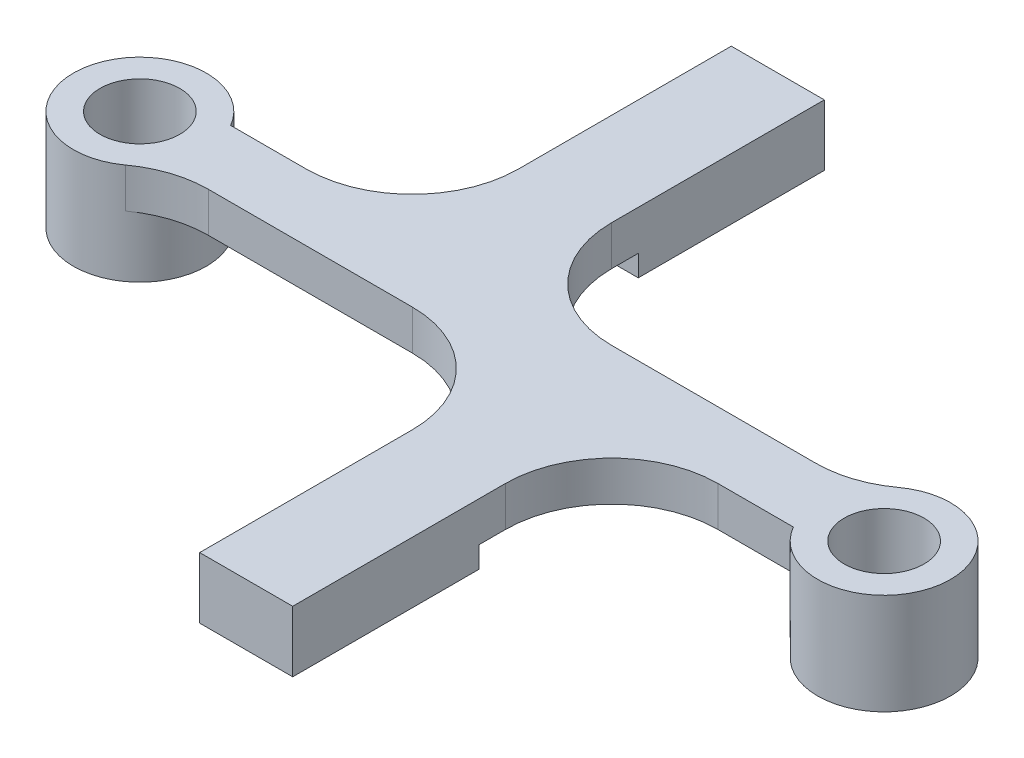
ISO-10303-21;
HEADER;
FILE_DESCRIPTION(('STEP AP214'),'2;1');
FILE_NAME('part.step','',(''),(''),'','','');
FILE_SCHEMA(('AUTOMOTIVE_DESIGN { 1 0 10303 214 1 1 1 1 }'));
ENDSEC;
DATA;
#1=APPLICATION_CONTEXT('core data for automotive mechanical design processes');
#2=APPLICATION_PROTOCOL_DEFINITION('international standard','automotive_design',2000,#1);
#3=PRODUCT_CONTEXT('',#1,'mechanical');
#4=PRODUCT('Part','Part','',(#3));
#5=PRODUCT_RELATED_PRODUCT_CATEGORY('part','',(#4));
#6=PRODUCT_DEFINITION_FORMATION('','',#4);
#7=PRODUCT_DEFINITION_CONTEXT('part definition',#1,'design');
#8=PRODUCT_DEFINITION('design','',#6,#7);
#9=PRODUCT_DEFINITION_SHAPE('','',#8);
#10=(LENGTH_UNIT() NAMED_UNIT(*) SI_UNIT(.MILLI.,.METRE.));
#11=(NAMED_UNIT(*) PLANE_ANGLE_UNIT() SI_UNIT($,.RADIAN.));
#12=(NAMED_UNIT(*) SI_UNIT($,.STERADIAN.) SOLID_ANGLE_UNIT());
#13=UNCERTAINTY_MEASURE_WITH_UNIT(LENGTH_MEASURE(1.E-05),#10,'distance_accuracy_value','');
#14=(GEOMETRIC_REPRESENTATION_CONTEXT(3) GLOBAL_UNCERTAINTY_ASSIGNED_CONTEXT((#13)) GLOBAL_UNIT_ASSIGNED_CONTEXT((#10,
#11,#12)) REPRESENTATION_CONTEXT('',''));
#15=CARTESIAN_POINT('',(0.,0.,0.));
#16=DIRECTION('',(0.,0.,1.));
#17=DIRECTION('',(1.,0.,0.));
#18=AXIS2_PLACEMENT_3D('',#15,#16,#17);
#19=CARTESIAN_POINT('',(-1.5,-12.5,0.));
#20=DIRECTION('',(1.,0.,0.));
#21=DIRECTION('',(0.,0.,-1.));
#22=AXIS2_PLACEMENT_3D('',#19,#20,#21);
#23=PLANE('',#22);
#24=DIRECTION('',(0.,0.,-1.));
#25=VECTOR('',#24,1.);
#26=CARTESIAN_POINT('',(-1.5,3.8,0.));
#27=LINE('',#26,#25);
#28=CARTESIAN_POINT('',(-1.5,3.8,-5.25));
#29=VERTEX_POINT('',#28);
#30=CARTESIAN_POINT('',(-1.5,3.8,-13.25));
#31=VERTEX_POINT('',#30);
#32=EDGE_CURVE('E239',#29,#31,#27,.T.);
#33=ORIENTED_EDGE('',*,*,#32,.F.);
#34=DIRECTION('',(0.,1.,0.));
#35=VECTOR('',#34,1.);
#36=CARTESIAN_POINT('',(-1.5,2.3,-5.25));
#37=LINE('',#36,#35);
#38=CARTESIAN_POINT('',(-1.5,2.3,-5.25));
#39=VERTEX_POINT('',#38);
#40=EDGE_CURVE('E296',#29,#39,#37,.F.);
#41=ORIENTED_EDGE('',*,*,#40,.T.);
#42=DIRECTION('',(0.,0.,1.));
#43=VECTOR('',#42,1.);
#44=CARTESIAN_POINT('',(-1.5,2.3,0.));
#45=LINE('',#44,#43);
#46=CARTESIAN_POINT('',(-1.5,2.3,-6.25));
#47=VERTEX_POINT('',#46);
#48=EDGE_CURVE('E376',#47,#39,#45,.T.);
#49=ORIENTED_EDGE('',*,*,#48,.F.);
#50=DIRECTION('',(0.,-1.,0.));
#51=VECTOR('',#50,1.);
#52=CARTESIAN_POINT('',(-1.5,30.567758347317,-6.25));
#53=LINE('',#52,#51);
#54=CARTESIAN_POINT('',(-1.5,1.5,-6.25));
#55=VERTEX_POINT('',#54);
#56=EDGE_CURVE('E229',#47,#55,#53,.T.);
#57=ORIENTED_EDGE('',*,*,#56,.T.);
#58=DIRECTION('',(0.,0.,1.));
#59=VECTOR('',#58,1.);
#60=CARTESIAN_POINT('',(-1.5,1.5,-13.25));
#61=LINE('',#60,#59);
#62=CARTESIAN_POINT('',(-1.5,1.5,-13.25));
#63=VERTEX_POINT('',#62);
#64=EDGE_CURVE('E212',#63,#55,#61,.T.);
#65=ORIENTED_EDGE('',*,*,#64,.F.);
#66=DIRECTION('',(0.,1.,0.));
#67=VECTOR('',#66,1.);
#68=CARTESIAN_POINT('',(-1.5,-12.5,-13.25));
#69=LINE('',#68,#67);
#70=EDGE_CURVE('E226',#63,#31,#69,.T.);
#71=ORIENTED_EDGE('',*,*,#70,.T.);
#72=EDGE_LOOP('',(#33,#41,#49,#57,#65,#71));
#73=FACE_BOUND('',#72,.T.);
#74=ADVANCED_FACE('F62',(#73),#23,.T.);
#75=CARTESIAN_POINT('',(0.,-12.5,-13.25));
#76=DIRECTION('',(0.,0.,1.));
#77=DIRECTION('',(1.,0.,0.));
#78=AXIS2_PLACEMENT_3D('',#75,#76,#77);
#79=PLANE('',#78);
#80=DIRECTION('',(1.,0.,0.));
#81=VECTOR('',#80,1.);
#82=CARTESIAN_POINT('',(-5.,1.5,-13.25));
#83=LINE('',#82,#81);
#84=CARTESIAN_POINT('',(-5.,1.5,-13.25));
#85=VERTEX_POINT('',#84);
#86=EDGE_CURVE('E209',#85,#63,#83,.T.);
#87=ORIENTED_EDGE('',*,*,#86,.F.);
#88=DIRECTION('',(0.,1.,0.));
#89=VECTOR('',#88,1.);
#90=CARTESIAN_POINT('',(-5.,-12.5,-13.25));
#91=LINE('',#90,#89);
#92=CARTESIAN_POINT('',(-5.,3.8,-13.25));
#93=VERTEX_POINT('',#92);
#94=EDGE_CURVE('E235',#85,#93,#91,.T.);
#95=ORIENTED_EDGE('',*,*,#94,.T.);
#96=DIRECTION('',(1.,0.,0.));
#97=VECTOR('',#96,1.);
#98=CARTESIAN_POINT('',(0.,3.8,-13.25));
#99=LINE('',#98,#97);
#100=EDGE_CURVE('E234',#93,#31,#99,.T.);
#101=ORIENTED_EDGE('',*,*,#100,.T.);
#102=ORIENTED_EDGE('',*,*,#70,.F.);
#103=EDGE_LOOP('',(#87,#95,#101,#102));
#104=FACE_BOUND('',#103,.T.);
#105=ADVANCED_FACE('F232',(#104),#79,.F.);
#106=CARTESIAN_POINT('',(-5.,-12.5,0.));
#107=DIRECTION('',(1.,0.,0.));
#108=DIRECTION('',(0.,0.,-1.));
#109=AXIS2_PLACEMENT_3D('',#106,#107,#108);
#110=PLANE('',#109);
#111=DIRECTION('',(0.,0.,-1.));
#112=VECTOR('',#111,1.);
#113=CARTESIAN_POINT('',(-5.,2.3,0.));
#114=LINE('',#113,#112);
#115=CARTESIAN_POINT('',(-5.,2.3,-5.25));
#116=VERTEX_POINT('',#115);
#117=CARTESIAN_POINT('',(-5.,2.3,-6.25));
#118=VERTEX_POINT('',#117);
#119=EDGE_CURVE('E383',#116,#118,#114,.T.);
#120=ORIENTED_EDGE('',*,*,#119,.F.);
#121=DIRECTION('',(0.,1.,0.));
#122=VECTOR('',#121,1.);
#123=CARTESIAN_POINT('',(-5.,-12.5,-5.25));
#124=LINE('',#123,#122);
#125=CARTESIAN_POINT('',(-5.,3.8,-5.25));
#126=VERTEX_POINT('',#125);
#127=EDGE_CURVE('E278',#116,#126,#124,.T.);
#128=ORIENTED_EDGE('',*,*,#127,.T.);
#129=DIRECTION('',(0.,0.,-1.));
#130=VECTOR('',#129,1.);
#131=CARTESIAN_POINT('',(-5.,3.8,0.));
#132=LINE('',#131,#130);
#133=EDGE_CURVE('E401',#126,#93,#132,.T.);
#134=ORIENTED_EDGE('',*,*,#133,.T.);
#135=ORIENTED_EDGE('',*,*,#94,.F.);
#136=DIRECTION('',(0.,0.,-1.));
#137=VECTOR('',#136,1.);
#138=CARTESIAN_POINT('',(-5.,1.5,-6.25));
#139=LINE('',#138,#137);
#140=CARTESIAN_POINT('',(-5.,1.5,-6.25));
#141=VERTEX_POINT('',#140);
#142=EDGE_CURVE('E215',#141,#85,#139,.T.);
#143=ORIENTED_EDGE('',*,*,#142,.F.);
#144=DIRECTION('',(0.,-1.,0.));
#145=VECTOR('',#144,1.);
#146=CARTESIAN_POINT('',(-5.,30.567758347317,-6.25));
#147=LINE('',#146,#145);
#148=EDGE_CURVE('E382',#118,#141,#147,.T.);
#149=ORIENTED_EDGE('',*,*,#148,.F.);
#150=EDGE_LOOP('',(#120,#128,#134,#135,#143,#149));
#151=FACE_BOUND('',#150,.T.);
#152=ADVANCED_FACE('F466',(#151),#110,.F.);
#153=CARTESIAN_POINT('',(5.,-12.5,1.25));
#154=DIRECTION('',(-1.,0.,0.));
#155=DIRECTION('',(0.,0.,1.));
#156=AXIS2_PLACEMENT_3D('',#153,#154,#155);
#157=PLANE('',#156);
#158=DIRECTION('',(0.,0.,1.));
#159=VECTOR('',#158,1.);
#160=CARTESIAN_POINT('',(5.,2.3,0.));
#161=LINE('',#160,#159);
#162=CARTESIAN_POINT('',(5.,2.3,5.25));
#163=VERTEX_POINT('',#162);
#164=CARTESIAN_POINT('',(5.,2.3,6.25));
#165=VERTEX_POINT('',#164);
#166=EDGE_CURVE('E365',#163,#165,#161,.T.);
#167=ORIENTED_EDGE('',*,*,#166,.F.);
#168=DIRECTION('',(0.,1.,0.));
#169=VECTOR('',#168,1.);
#170=CARTESIAN_POINT('',(5.,3.8,5.25));
#171=LINE('',#170,#169);
#172=CARTESIAN_POINT('',(5.,3.8,5.25));
#173=VERTEX_POINT('',#172);
#174=EDGE_CURVE('E283',#163,#173,#171,.T.);
#175=ORIENTED_EDGE('',*,*,#174,.T.);
#176=DIRECTION('',(0.,0.,1.));
#177=VECTOR('',#176,1.);
#178=CARTESIAN_POINT('',(5.,3.8,6.25));
#179=LINE('',#178,#177);
#180=CARTESIAN_POINT('',(5.,3.8,13.25));
#181=VERTEX_POINT('',#180);
#182=EDGE_CURVE('E396',#173,#181,#179,.T.);
#183=ORIENTED_EDGE('',*,*,#182,.T.);
#184=DIRECTION('',(0.,1.,0.));
#185=VECTOR('',#184,1.);
#186=CARTESIAN_POINT('',(5.,-12.5,13.25));
#187=LINE('',#186,#185);
#188=CARTESIAN_POINT('',(5.,1.5,13.25));
#189=VERTEX_POINT('',#188);
#190=EDGE_CURVE('E354',#189,#181,#187,.T.);
#191=ORIENTED_EDGE('',*,*,#190,.F.);
#192=DIRECTION('',(0.,0.,1.));
#193=VECTOR('',#192,1.);
#194=CARTESIAN_POINT('',(5.,1.5,6.25));
#195=LINE('',#194,#193);
#196=CARTESIAN_POINT('',(5.,1.5,6.25));
#197=VERTEX_POINT('',#196);
#198=EDGE_CURVE('E440',#197,#189,#195,.T.);
#199=ORIENTED_EDGE('',*,*,#198,.F.);
#200=DIRECTION('',(0.,-1.,0.));
#201=VECTOR('',#200,1.);
#202=CARTESIAN_POINT('',(5.,30.567758347317,6.25));
#203=LINE('',#202,#201);
#204=EDGE_CURVE('E367',#165,#197,#203,.T.);
#205=ORIENTED_EDGE('',*,*,#204,.F.);
#206=EDGE_LOOP('',(#167,#175,#183,#191,#199,#205));
#207=FACE_BOUND('',#206,.T.);
#208=ADVANCED_FACE('F437',(#207),#157,.F.);
#209=CARTESIAN_POINT('',(1.5,-12.5,1.25));
#210=DIRECTION('',(-1.,0.,0.));
#211=DIRECTION('',(0.,0.,1.));
#212=AXIS2_PLACEMENT_3D('',#209,#210,#211);
#213=PLANE('',#212);
#214=DIRECTION('',(0.,0.,1.));
#215=VECTOR('',#214,1.);
#216=CARTESIAN_POINT('',(1.5,3.8,6.25));
#217=LINE('',#216,#215);
#218=CARTESIAN_POINT('',(1.5,3.8,5.25));
#219=VERTEX_POINT('',#218);
#220=CARTESIAN_POINT('',(1.5,3.8,13.25));
#221=VERTEX_POINT('',#220);
#222=EDGE_CURVE('E393',#219,#221,#217,.T.);
#223=ORIENTED_EDGE('',*,*,#222,.F.);
#224=DIRECTION('',(0.,1.,0.));
#225=VECTOR('',#224,1.);
#226=CARTESIAN_POINT('',(1.5,-12.5,5.25));
#227=LINE('',#226,#225);
#228=CARTESIAN_POINT('',(1.5,2.3,5.25));
#229=VERTEX_POINT('',#228);
#230=EDGE_CURVE('E77',#219,#229,#227,.F.);
#231=ORIENTED_EDGE('',*,*,#230,.T.);
#232=DIRECTION('',(0.,0.,-1.));
#233=VECTOR('',#232,1.);
#234=CARTESIAN_POINT('',(1.5,2.3,0.));
#235=LINE('',#234,#233);
#236=CARTESIAN_POINT('',(1.5,2.3,6.25));
#237=VERTEX_POINT('',#236);
#238=EDGE_CURVE('E351',#237,#229,#235,.T.);
#239=ORIENTED_EDGE('',*,*,#238,.F.);
#240=DIRECTION('',(0.,-1.,0.));
#241=VECTOR('',#240,1.);
#242=CARTESIAN_POINT('',(1.5,30.567758347317,6.25));
#243=LINE('',#242,#241);
#244=CARTESIAN_POINT('',(1.5,1.5,6.25));
#245=VERTEX_POINT('',#244);
#246=EDGE_CURVE('E356',#237,#245,#243,.T.);
#247=ORIENTED_EDGE('',*,*,#246,.T.);
#248=DIRECTION('',(0.,0.,-1.));
#249=VECTOR('',#248,1.);
#250=CARTESIAN_POINT('',(1.5,1.5,13.25));
#251=LINE('',#250,#249);
#252=CARTESIAN_POINT('',(1.5,1.5,13.25));
#253=VERTEX_POINT('',#252);
#254=EDGE_CURVE('E447',#253,#245,#251,.T.);
#255=ORIENTED_EDGE('',*,*,#254,.F.);
#256=DIRECTION('',(0.,1.,0.));
#257=VECTOR('',#256,1.);
#258=CARTESIAN_POINT('',(1.5,-12.5,13.25));
#259=LINE('',#258,#257);
#260=EDGE_CURVE('E350',#253,#221,#259,.T.);
#261=ORIENTED_EDGE('',*,*,#260,.T.);
#262=EDGE_LOOP('',(#223,#231,#239,#247,#255,#261));
#263=FACE_BOUND('',#262,.T.);
#264=ADVANCED_FACE('F445',(#263),#213,.T.);
#265=CARTESIAN_POINT('',(1.5,-12.5,13.25));
#266=DIRECTION('',(0.,0.,1.));
#267=DIRECTION('',(1.,0.,0.));
#268=AXIS2_PLACEMENT_3D('',#265,#266,#267);
#269=PLANE('',#268);
#270=ORIENTED_EDGE('',*,*,#260,.F.);
#271=DIRECTION('',(-1.,0.,0.));
#272=VECTOR('',#271,1.);
#273=CARTESIAN_POINT('',(5.,1.5,13.25));
#274=LINE('',#273,#272);
#275=EDGE_CURVE('E220',#189,#253,#274,.T.);
#276=ORIENTED_EDGE('',*,*,#275,.F.);
#277=ORIENTED_EDGE('',*,*,#190,.T.);
#278=DIRECTION('',(1.,0.,0.));
#279=VECTOR('',#278,1.);
#280=CARTESIAN_POINT('',(1.5,3.8,13.25));
#281=LINE('',#280,#279);
#282=EDGE_CURVE('E398',#221,#181,#281,.T.);
#283=ORIENTED_EDGE('',*,*,#282,.F.);
#284=EDGE_LOOP('',(#270,#276,#277,#283));
#285=FACE_BOUND('',#284,.T.);
#286=ADVANCED_FACE('F454',(#285),#269,.T.);
#287=CARTESIAN_POINT('',(0.,30.567758347317,-6.25));
#288=DIRECTION('',(0.,0.,-1.));
#289=DIRECTION('',(-1.,0.,0.));
#290=AXIS2_PLACEMENT_3D('',#287,#288,#289);
#291=PLANE('',#290);
#292=DIRECTION('',(-1.,0.,0.));
#293=VECTOR('',#292,1.);
#294=CARTESIAN_POINT('',(-1.5,1.5,-6.25));
#295=LINE('',#294,#293);
#296=EDGE_CURVE('E230',#55,#141,#295,.T.);
#297=ORIENTED_EDGE('',*,*,#296,.F.);
#298=ORIENTED_EDGE('',*,*,#56,.F.);
#299=DIRECTION('',(1.,0.,0.));
#300=VECTOR('',#299,1.);
#301=CARTESIAN_POINT('',(0.,2.3,-6.25));
#302=LINE('',#301,#300);
#303=EDGE_CURVE('E379',#118,#47,#302,.T.);
#304=ORIENTED_EDGE('',*,*,#303,.F.);
#305=ORIENTED_EDGE('',*,*,#148,.T.);
#306=EDGE_LOOP('',(#297,#298,#304,#305));
#307=FACE_BOUND('',#306,.T.);
#308=ADVANCED_FACE('F652',(#307),#291,.F.);
#309=CARTESIAN_POINT('',(0.,30.567758347317,6.25));
#310=DIRECTION('',(0.,0.,-1.));
#311=DIRECTION('',(-1.,0.,0.));
#312=AXIS2_PLACEMENT_3D('',#309,#310,#311);
#313=PLANE('',#312);
#314=ORIENTED_EDGE('',*,*,#204,.T.);
#315=DIRECTION('',(1.,0.,0.));
#316=VECTOR('',#315,1.);
#317=CARTESIAN_POINT('',(1.5,1.5,6.25));
#318=LINE('',#317,#316);
#319=EDGE_CURVE('E444',#245,#197,#318,.T.);
#320=ORIENTED_EDGE('',*,*,#319,.F.);
#321=ORIENTED_EDGE('',*,*,#246,.F.);
#322=DIRECTION('',(1.,0.,0.));
#323=VECTOR('',#322,1.);
#324=CARTESIAN_POINT('',(0.,2.3,6.25));
#325=LINE('',#324,#323);
#326=EDGE_CURVE('E361',#237,#165,#325,.T.);
#327=ORIENTED_EDGE('',*,*,#326,.T.);
#328=EDGE_LOOP('',(#314,#320,#321,#327));
#329=FACE_BOUND('',#328,.T.);
#330=ADVANCED_FACE('F443',(#329),#313,.T.);
#331=CARTESIAN_POINT('',(0.,0.,0.));
#332=DIRECTION('',(0.,1.,0.));
#333=DIRECTION('',(0.,0.,1.));
#334=AXIS2_PLACEMENT_3D('',#331,#332,#333);
#335=PLANE('',#334);
#336=CARTESIAN_POINT('',(14.,0.,0.));
#337=DIRECTION('',(0.,1.,0.));
#338=DIRECTION('',(0.,0.,1.));
#339=AXIS2_PLACEMENT_3D('',#336,#337,#338);
#340=CIRCLE('',#339,1.5);
#341=CARTESIAN_POINT('',(14.,0.,-1.5));
#342=VERTEX_POINT('',#341);
#343=EDGE_CURVE('E246',#342,#342,#340,.T.);
#344=ORIENTED_EDGE('',*,*,#343,.T.);
#345=EDGE_LOOP('',(#344));
#346=FACE_BOUND('',#345,.T.);
#347=CARTESIAN_POINT('',(14.,0.,0.));
#348=DIRECTION('',(0.,1.,0.));
#349=DIRECTION('',(0.,0.,1.));
#350=AXIS2_PLACEMENT_3D('',#347,#348,#349);
#351=CIRCLE('',#350,2.5);
#352=CARTESIAN_POINT('',(14.,0.,2.5));
#353=VERTEX_POINT('',#352);
#354=EDGE_CURVE('E268',#353,#353,#351,.T.);
#355=ORIENTED_EDGE('',*,*,#354,.F.);
#356=EDGE_LOOP('',(#355));
#357=FACE_BOUND('',#356,.T.);
#358=ADVANCED_FACE('F477',(#346,#357),#335,.F.);
#359=CARTESIAN_POINT('',(-14.,0.,0.));
#360=DIRECTION('',(0.,1.,0.));
#361=DIRECTION('',(0.,0.,1.));
#362=AXIS2_PLACEMENT_3D('',#359,#360,#361);
#363=CIRCLE('',#362,1.5);
#364=CARTESIAN_POINT('',(-14.,0.,-1.5));
#365=VERTEX_POINT('',#364);
#366=EDGE_CURVE('E237',#365,#365,#363,.T.);
#367=ORIENTED_EDGE('',*,*,#366,.T.);
#368=EDGE_LOOP('',(#367));
#369=FACE_BOUND('',#368,.T.);
#370=CARTESIAN_POINT('',(-14.,0.,0.));
#371=DIRECTION('',(0.,1.,0.));
#372=DIRECTION('',(0.,0.,1.));
#373=AXIS2_PLACEMENT_3D('',#370,#371,#372);
#374=CIRCLE('',#373,2.5);
#375=CARTESIAN_POINT('',(-14.,0.,2.5));
#376=VERTEX_POINT('',#375);
#377=EDGE_CURVE('E265',#376,#376,#374,.T.);
#378=ORIENTED_EDGE('',*,*,#377,.F.);
#379=EDGE_LOOP('',(#378));
#380=FACE_BOUND('',#379,.T.);
#381=ADVANCED_FACE('F480',(#369,#380),#335,.F.);
#382=CARTESIAN_POINT('',(0.,3.8,1.25));
#383=DIRECTION('',(0.,0.,-1.));
#384=DIRECTION('',(-1.,0.,0.));
#385=AXIS2_PLACEMENT_3D('',#382,#383,#384);
#386=PLANE('',#385);
#387=DIRECTION('',(1.,0.,0.));
#388=VECTOR('',#387,1.);
#389=CARTESIAN_POINT('',(0.,3.8,1.25));
#390=LINE('',#389,#388);
#391=CARTESIAN_POINT('',(9.,3.8,1.25));
#392=VERTEX_POINT('',#391);
#393=CARTESIAN_POINT('',(11.8349364905389,3.8,1.25));
#394=VERTEX_POINT('',#393);
#395=EDGE_CURVE('E249',#392,#394,#390,.T.);
#396=ORIENTED_EDGE('',*,*,#395,.F.);
#397=DIRECTION('',(0.,1.,0.));
#398=VECTOR('',#397,1.);
#399=CARTESIAN_POINT('',(9.,2.3,1.25));
#400=LINE('',#399,#398);
#401=CARTESIAN_POINT('',(9.,2.3,1.25));
#402=VERTEX_POINT('',#401);
#403=EDGE_CURVE('E286',#392,#402,#400,.F.);
#404=ORIENTED_EDGE('',*,*,#403,.T.);
#405=DIRECTION('',(-1.,0.,0.));
#406=VECTOR('',#405,1.);
#407=CARTESIAN_POINT('',(0.,2.3,1.25));
#408=LINE('',#407,#406);
#409=CARTESIAN_POINT('',(11.8349364905389,2.3,1.25));
#410=VERTEX_POINT('',#409);
#411=EDGE_CURVE('E368',#410,#402,#408,.T.);
#412=ORIENTED_EDGE('',*,*,#411,.F.);
#413=DIRECTION('',(0.,-1.,0.));
#414=VECTOR('',#413,1.);
#415=CARTESIAN_POINT('',(11.8349364905389,3.8,1.25));
#416=LINE('',#415,#414);
#417=EDGE_CURVE('E275',#394,#410,#416,.T.);
#418=ORIENTED_EDGE('',*,*,#417,.F.);
#419=EDGE_LOOP('',(#396,#404,#412,#418));
#420=FACE_BOUND('',#419,.T.);
#421=ADVANCED_FACE('F425',(#420),#386,.F.);
#422=CARTESIAN_POINT('',(0.,3.8,-1.25));
#423=DIRECTION('',(0.,0.,-1.));
#424=DIRECTION('',(-1.,0.,0.));
#425=AXIS2_PLACEMENT_3D('',#422,#423,#424);
#426=PLANE('',#425);
#427=DIRECTION('',(1.,0.,0.));
#428=VECTOR('',#427,1.);
#429=CARTESIAN_POINT('',(0.,3.8,-1.25));
#430=LINE('',#429,#428);
#431=CARTESIAN_POINT('',(-11.8349364905389,3.8,-1.25));
#432=VERTEX_POINT('',#431);
#433=CARTESIAN_POINT('',(-9.,3.8,-1.25));
#434=VERTEX_POINT('',#433);
#435=EDGE_CURVE('E256',#432,#434,#430,.T.);
#436=ORIENTED_EDGE('',*,*,#435,.T.);
#437=DIRECTION('',(0.,1.,0.));
#438=VECTOR('',#437,1.);
#439=CARTESIAN_POINT('',(-9.,3.8,-1.25));
#440=LINE('',#439,#438);
#441=CARTESIAN_POINT('',(-9.,2.3,-1.25));
#442=VERTEX_POINT('',#441);
#443=EDGE_CURVE('E281',#434,#442,#440,.F.);
#444=ORIENTED_EDGE('',*,*,#443,.T.);
#445=DIRECTION('',(1.,0.,0.));
#446=VECTOR('',#445,1.);
#447=CARTESIAN_POINT('',(0.,2.3,-1.25));
#448=LINE('',#447,#446);
#449=CARTESIAN_POINT('',(-11.8349364905389,2.3,-1.25));
#450=VERTEX_POINT('',#449);
#451=EDGE_CURVE('E373',#450,#442,#448,.T.);
#452=ORIENTED_EDGE('',*,*,#451,.F.);
#453=DIRECTION('',(0.,-1.,0.));
#454=VECTOR('',#453,1.);
#455=CARTESIAN_POINT('',(-11.8349364905389,3.8,-1.25));
#456=LINE('',#455,#454);
#457=EDGE_CURVE('E262',#432,#450,#456,.T.);
#458=ORIENTED_EDGE('',*,*,#457,.F.);
#459=EDGE_LOOP('',(#436,#444,#452,#458));
#460=FACE_BOUND('',#459,.T.);
#461=ADVANCED_FACE('F488',(#460),#426,.T.);
#462=CARTESIAN_POINT('',(-14.,3.8,0.));
#463=DIRECTION('',(0.,-1.,0.));
#464=DIRECTION('',(0.,0.,-1.));
#465=AXIS2_PLACEMENT_3D('',#462,#463,#464);
#466=CYLINDRICAL_SURFACE('',#465,2.5);
#467=ORIENTED_EDGE('',*,*,#377,.T.);
#468=EDGE_LOOP('',(#467));
#469=FACE_BOUND('',#468,.T.);
#470=CARTESIAN_POINT('',(-14.,2.3,0.));
#471=DIRECTION('',(0.,1.,0.));
#472=DIRECTION('',(0.,0.,1.));
#473=AXIS2_PLACEMENT_3D('',#470,#471,#472);
#474=CIRCLE('',#473,2.5);
#475=CARTESIAN_POINT('',(-12.5259894503119,2.3,2.01923076923077));
#476=VERTEX_POINT('',#475);
#477=EDGE_CURVE('E346',#450,#476,#474,.F.);
#478=ORIENTED_EDGE('',*,*,#477,.T.);
#479=DIRECTION('',(0.,-1.,0.));
#480=VECTOR('',#479,1.);
#481=CARTESIAN_POINT('',(-12.5259894503119,3.8,2.01923076923077));
#482=LINE('',#481,#480);
#483=CARTESIAN_POINT('',(-12.5259894503119,3.8,2.01923076923077));
#484=VERTEX_POINT('',#483);
#485=EDGE_CURVE('E304',#476,#484,#482,.F.);
#486=ORIENTED_EDGE('',*,*,#485,.T.);
#487=CARTESIAN_POINT('',(-14.,3.8,0.));
#488=DIRECTION('',(0.,1.,0.));
#489=DIRECTION('',(0.,0.,1.));
#490=AXIS2_PLACEMENT_3D('',#487,#488,#489);
#491=CIRCLE('',#490,2.5);
#492=EDGE_CURVE('E245',#432,#484,#491,.T.);
#493=ORIENTED_EDGE('',*,*,#492,.F.);
#494=ORIENTED_EDGE('',*,*,#457,.T.);
#495=EDGE_LOOP('',(#478,#486,#493,#494));
#496=FACE_BOUND('',#495,.T.);
#497=ADVANCED_FACE('F494',(#469,#496),#466,.T.);
#498=CARTESIAN_POINT('',(-10.167572570811,3.8,1.25));
#499=VERTEX_POINT('',#498);
#500=CARTESIAN_POINT('',(-2.5,3.8,1.25));
#501=VERTEX_POINT('',#500);
#502=EDGE_CURVE('E250',#499,#501,#390,.T.);
#503=ORIENTED_EDGE('',*,*,#502,.F.);
#504=DIRECTION('',(0.,1.,0.));
#505=VECTOR('',#504,1.);
#506=CARTESIAN_POINT('',(-10.167572570811,2.3,1.25));
#507=LINE('',#506,#505);
#508=CARTESIAN_POINT('',(-10.167572570811,2.3,1.25));
#509=VERTEX_POINT('',#508);
#510=EDGE_CURVE('E301',#499,#509,#507,.F.);
#511=ORIENTED_EDGE('',*,*,#510,.T.);
#512=DIRECTION('',(-1.,0.,0.));
#513=VECTOR('',#512,1.);
#514=CARTESIAN_POINT('',(0.,2.3,1.25));
#515=LINE('',#514,#513);
#516=CARTESIAN_POINT('',(-2.5,2.3,1.25));
#517=VERTEX_POINT('',#516);
#518=EDGE_CURVE('E348',#517,#509,#515,.T.);
#519=ORIENTED_EDGE('',*,*,#518,.F.);
#520=DIRECTION('',(0.,1.,0.));
#521=VECTOR('',#520,1.);
#522=CARTESIAN_POINT('',(-2.5,3.8,1.25));
#523=LINE('',#522,#521);
#524=EDGE_CURVE('E298',#517,#501,#523,.T.);
#525=ORIENTED_EDGE('',*,*,#524,.T.);
#526=EDGE_LOOP('',(#503,#511,#519,#525));
#527=FACE_BOUND('',#526,.T.);
#528=ADVANCED_FACE('F338',(#527),#386,.F.);
#529=CARTESIAN_POINT('',(14.,3.8,0.));
#530=DIRECTION('',(0.,-1.,0.));
#531=DIRECTION('',(0.,0.,-1.));
#532=AXIS2_PLACEMENT_3D('',#529,#530,#531);
#533=CYLINDRICAL_SURFACE('',#532,2.5);
#534=ORIENTED_EDGE('',*,*,#354,.T.);
#535=EDGE_LOOP('',(#534));
#536=FACE_BOUND('',#535,.T.);
#537=CARTESIAN_POINT('',(14.,2.3,0.));
#538=DIRECTION('',(0.,1.,0.));
#539=DIRECTION('',(0.,0.,1.));
#540=AXIS2_PLACEMENT_3D('',#537,#538,#539);
#541=CIRCLE('',#540,2.5);
#542=CARTESIAN_POINT('',(12.5259894503119,2.3,-2.01923076923077));
#543=VERTEX_POINT('',#542);
#544=EDGE_CURVE('E364',#410,#543,#541,.F.);
#545=ORIENTED_EDGE('',*,*,#544,.T.);
#546=DIRECTION('',(0.,-1.,0.));
#547=VECTOR('',#546,1.);
#548=CARTESIAN_POINT('',(12.5259894503119,3.8,-2.01923076923077));
#549=LINE('',#548,#547);
#550=CARTESIAN_POINT('',(12.5259894503119,3.8,-2.01923076923077));
#551=VERTEX_POINT('',#550);
#552=EDGE_CURVE('E294',#543,#551,#549,.F.);
#553=ORIENTED_EDGE('',*,*,#552,.T.);
#554=CARTESIAN_POINT('',(14.,3.8,0.));
#555=DIRECTION('',(0.,1.,0.));
#556=DIRECTION('',(0.,0.,1.));
#557=AXIS2_PLACEMENT_3D('',#554,#555,#556);
#558=CIRCLE('',#557,2.5);
#559=EDGE_CURVE('E252',#394,#551,#558,.T.);
#560=ORIENTED_EDGE('',*,*,#559,.F.);
#561=ORIENTED_EDGE('',*,*,#417,.T.);
#562=EDGE_LOOP('',(#545,#553,#560,#561));
#563=FACE_BOUND('',#562,.T.);
#564=ADVANCED_FACE('F428',(#536,#563),#533,.T.);
#565=CARTESIAN_POINT('',(2.5,3.8,-1.25));
#566=VERTEX_POINT('',#565);
#567=CARTESIAN_POINT('',(10.167572570811,3.8,-1.25));
#568=VERTEX_POINT('',#567);
#569=EDGE_CURVE('E255',#566,#568,#430,.T.);
#570=ORIENTED_EDGE('',*,*,#569,.T.);
#571=DIRECTION('',(0.,-1.,0.));
#572=VECTOR('',#571,1.);
#573=CARTESIAN_POINT('',(10.167572570811,3.8,-1.25));
#574=LINE('',#573,#572);
#575=CARTESIAN_POINT('',(10.167572570811,2.3,-1.25));
#576=VERTEX_POINT('',#575);
#577=EDGE_CURVE('E291',#568,#576,#574,.T.);
#578=ORIENTED_EDGE('',*,*,#577,.T.);
#579=DIRECTION('',(1.,0.,0.));
#580=VECTOR('',#579,1.);
#581=CARTESIAN_POINT('',(0.,2.3,-1.25));
#582=LINE('',#581,#580);
#583=CARTESIAN_POINT('',(2.5,2.3,-1.25));
#584=VERTEX_POINT('',#583);
#585=EDGE_CURVE('E371',#584,#576,#582,.T.);
#586=ORIENTED_EDGE('',*,*,#585,.F.);
#587=DIRECTION('',(0.,1.,0.));
#588=VECTOR('',#587,1.);
#589=CARTESIAN_POINT('',(2.5,3.8,-1.25));
#590=LINE('',#589,#588);
#591=EDGE_CURVE('E288',#584,#566,#590,.T.);
#592=ORIENTED_EDGE('',*,*,#591,.T.);
#593=EDGE_LOOP('',(#570,#578,#586,#592));
#594=FACE_BOUND('',#593,.T.);
#595=ADVANCED_FACE('F413',(#594),#426,.T.);
#596=CARTESIAN_POINT('',(-14.,3.8,0.));
#597=DIRECTION('',(0.,-1.,0.));
#598=DIRECTION('',(0.,0.,-1.));
#599=AXIS2_PLACEMENT_3D('',#596,#597,#598);
#600=CYLINDRICAL_SURFACE('',#599,1.5);
#601=CARTESIAN_POINT('',(-14.,3.8,0.));
#602=DIRECTION('',(0.,1.,0.));
#603=DIRECTION('',(0.,0.,1.));
#604=AXIS2_PLACEMENT_3D('',#601,#602,#603);
#605=CIRCLE('',#604,1.5);
#606=CARTESIAN_POINT('',(-14.,3.8,-1.5));
#607=VERTEX_POINT('',#606);
#608=EDGE_CURVE('E242',#607,#607,#605,.T.);
#609=CARTESIAN_POINT('',(-14.,3.8,-1.5));
#610=CARTESIAN_POINT('',(-14.,3.76041666666667,-1.5));
#611=CARTESIAN_POINT('',(-14.,3.72083333333333,-1.5));
#612=CARTESIAN_POINT('',(-14.,3.64166666666667,-1.5));
#613=CARTESIAN_POINT('',(-14.,3.60208333333333,-1.5));
#614=CARTESIAN_POINT('',(-14.,3.52291666666667,-1.5));
#615=CARTESIAN_POINT('',(-14.,3.48333333333333,-1.5));
#616=CARTESIAN_POINT('',(-14.,3.40416666666667,-1.5));
#617=CARTESIAN_POINT('',(-14.,3.36458333333333,-1.5));
#618=CARTESIAN_POINT('',(-14.,3.28541666666667,-1.5));
#619=CARTESIAN_POINT('',(-14.,3.24583333333333,-1.5));
#620=CARTESIAN_POINT('',(-14.,3.16666666666667,-1.5));
#621=CARTESIAN_POINT('',(-14.,3.12708333333333,-1.5));
#622=CARTESIAN_POINT('',(-14.,3.04791666666667,-1.5));
#623=CARTESIAN_POINT('',(-14.,3.00833333333333,-1.5));
#624=CARTESIAN_POINT('',(-14.,2.92916666666667,-1.5));
#625=CARTESIAN_POINT('',(-14.,2.88958333333333,-1.5));
#626=CARTESIAN_POINT('',(-14.,2.81041666666667,-1.5));
#627=CARTESIAN_POINT('',(-14.,2.77083333333333,-1.5));
#628=CARTESIAN_POINT('',(-14.,2.69166666666667,-1.5));
#629=CARTESIAN_POINT('',(-14.,2.65208333333333,-1.5));
#630=CARTESIAN_POINT('',(-14.,2.57291666666667,-1.5));
#631=CARTESIAN_POINT('',(-14.,2.53333333333333,-1.5));
#632=CARTESIAN_POINT('',(-14.,2.45416666666667,-1.5));
#633=CARTESIAN_POINT('',(-14.,2.41458333333333,-1.5));
#634=CARTESIAN_POINT('',(-14.,2.33541666666667,-1.5));
#635=CARTESIAN_POINT('',(-14.,2.29583333333333,-1.5));
#636=CARTESIAN_POINT('',(-14.,2.21666666666667,-1.5));
#637=CARTESIAN_POINT('',(-14.,2.17708333333333,-1.5));
#638=CARTESIAN_POINT('',(-14.,2.09791666666667,-1.5));
#639=CARTESIAN_POINT('',(-14.,2.05833333333333,-1.5));
#640=CARTESIAN_POINT('',(-14.,1.97916666666667,-1.5));
#641=CARTESIAN_POINT('',(-14.,1.93958333333333,-1.5));
#642=CARTESIAN_POINT('',(-14.,1.86041666666667,-1.5));
#643=CARTESIAN_POINT('',(-14.,1.82083333333333,-1.5));
#644=CARTESIAN_POINT('',(-14.,1.74166666666667,-1.5));
#645=CARTESIAN_POINT('',(-14.,1.70208333333333,-1.5));
#646=CARTESIAN_POINT('',(-14.,1.62291666666667,-1.5));
#647=CARTESIAN_POINT('',(-14.,1.58333333333333,-1.5));
#648=CARTESIAN_POINT('',(-14.,1.50416666666667,-1.5));
#649=CARTESIAN_POINT('',(-14.,1.46458333333333,-1.5));
#650=CARTESIAN_POINT('',(-14.,1.38541666666667,-1.5));
#651=CARTESIAN_POINT('',(-14.,1.34583333333333,-1.5));
#652=CARTESIAN_POINT('',(-14.,1.26666666666667,-1.5));
#653=CARTESIAN_POINT('',(-14.,1.22708333333333,-1.5));
#654=CARTESIAN_POINT('',(-14.,1.14791666666667,-1.5));
#655=CARTESIAN_POINT('',(-14.,1.10833333333333,-1.5));
#656=CARTESIAN_POINT('',(-14.,1.02916666666667,-1.5));
#657=CARTESIAN_POINT('',(-14.,0.989583333333333,-1.5));
#658=CARTESIAN_POINT('',(-14.,0.910416666666667,-1.5));
#659=CARTESIAN_POINT('',(-14.,0.870833333333333,-1.5));
#660=CARTESIAN_POINT('',(-14.,0.791666666666667,-1.5));
#661=CARTESIAN_POINT('',(-14.,0.752083333333333,-1.5));
#662=CARTESIAN_POINT('',(-14.,0.672916666666667,-1.5));
#663=CARTESIAN_POINT('',(-14.,0.633333333333333,-1.5));
#664=CARTESIAN_POINT('',(-14.,0.554166666666667,-1.5));
#665=CARTESIAN_POINT('',(-14.,0.514583333333334,-1.5));
#666=CARTESIAN_POINT('',(-14.,0.435416666666667,-1.5));
#667=CARTESIAN_POINT('',(-14.,0.395833333333333,-1.5));
#668=CARTESIAN_POINT('',(-14.,0.316666666666666,-1.5));
#669=CARTESIAN_POINT('',(-14.,0.277083333333333,-1.5));
#670=CARTESIAN_POINT('',(-14.,0.197916666666667,-1.5));
#671=CARTESIAN_POINT('',(-14.,0.158333333333333,-1.5));
#672=CARTESIAN_POINT('',(-14.,0.0791666666666666,-1.5));
#673=CARTESIAN_POINT('',(-14.,0.0395833333333333,-1.5));
#674=CARTESIAN_POINT('',(-14.,0.,-1.5));
#675=B_SPLINE_CURVE_WITH_KNOTS('',3,(#609,#610,#611,#612,#613,#614,#615,#616,#617,#618,#619,
#620,#621,#622,#623,#624,#625,#626,#627,#628,#629,#630,#631,#632,#633,#634,#635,#636,#637,#638,
#639,#640,#641,#642,#643,#644,#645,#646,#647,#648,#649,#650,#651,#652,#653,#654,#655,#656,#657,
#658,#659,#660,#661,#662,#663,#664,#665,#666,#667,#668,#669,#670,#671,#672,#673,#674),
.UNSPECIFIED.,.F.,.F.,(4,2,2,2,2,2,2,2,2,2,2,2,2,2,2,2,2,2,2,2,2,2,2,2,2,2,2,2,2,2,2,2,4),(0.,
0.11875,0.2375,0.35625,0.475,0.59375,0.7125,0.831249999999999,0.95,1.06875,1.1875,1.30625,1.425,
1.54375,1.6625,1.78125,1.9,2.01875,2.1375,2.25625,2.375,2.49375,2.6125,2.73125,2.85,2.96875,
3.0875,3.20625,3.325,3.44375,3.5625,3.68125,3.8),.UNSPECIFIED.);
#676=EDGE_CURVE('BSEAM484',#607,#365,#675,.T.);
#677=ORIENTED_EDGE('',*,*,#608,.T.);
#678=ORIENTED_EDGE('',*,*,#366,.F.);
#679=ORIENTED_EDGE('',*,*,#676,.T.);
#680=ORIENTED_EDGE('',*,*,#676,.F.);
#681=EDGE_LOOP('',(#677,#679,#678,#680));
#682=FACE_BOUND('',#681,.T.);
#683=ADVANCED_FACE('F484',(#682),#600,.F.);
#684=CARTESIAN_POINT('',(14.,3.8,0.));
#685=DIRECTION('',(0.,-1.,0.));
#686=DIRECTION('',(0.,0.,-1.));
#687=AXIS2_PLACEMENT_3D('',#684,#685,#686);
#688=CYLINDRICAL_SURFACE('',#687,1.5);
#689=CARTESIAN_POINT('',(14.,3.8,0.));
#690=DIRECTION('',(0.,1.,0.));
#691=DIRECTION('',(0.,0.,1.));
#692=AXIS2_PLACEMENT_3D('',#689,#690,#691);
#693=CIRCLE('',#692,1.5);
#694=CARTESIAN_POINT('',(14.,3.8,-1.5));
#695=VERTEX_POINT('',#694);
#696=EDGE_CURVE('E259',#695,#695,#693,.T.);
#697=CARTESIAN_POINT('',(14.,3.8,-1.5));
#698=CARTESIAN_POINT('',(14.,3.76041666666667,-1.5));
#699=CARTESIAN_POINT('',(14.,3.72083333333333,-1.5));
#700=CARTESIAN_POINT('',(14.,3.64166666666667,-1.5));
#701=CARTESIAN_POINT('',(14.,3.60208333333333,-1.5));
#702=CARTESIAN_POINT('',(14.,3.52291666666667,-1.5));
#703=CARTESIAN_POINT('',(14.,3.48333333333333,-1.5));
#704=CARTESIAN_POINT('',(14.,3.40416666666667,-1.5));
#705=CARTESIAN_POINT('',(14.,3.36458333333333,-1.5));
#706=CARTESIAN_POINT('',(14.,3.28541666666667,-1.5));
#707=CARTESIAN_POINT('',(14.,3.24583333333333,-1.5));
#708=CARTESIAN_POINT('',(14.,3.16666666666667,-1.5));
#709=CARTESIAN_POINT('',(14.,3.12708333333333,-1.5));
#710=CARTESIAN_POINT('',(14.,3.04791666666667,-1.5));
#711=CARTESIAN_POINT('',(14.,3.00833333333333,-1.5));
#712=CARTESIAN_POINT('',(14.,2.92916666666667,-1.5));
#713=CARTESIAN_POINT('',(14.,2.88958333333333,-1.5));
#714=CARTESIAN_POINT('',(14.,2.81041666666667,-1.5));
#715=CARTESIAN_POINT('',(14.,2.77083333333333,-1.5));
#716=CARTESIAN_POINT('',(14.,2.69166666666667,-1.5));
#717=CARTESIAN_POINT('',(14.,2.65208333333333,-1.5));
#718=CARTESIAN_POINT('',(14.,2.57291666666667,-1.5));
#719=CARTESIAN_POINT('',(14.,2.53333333333333,-1.5));
#720=CARTESIAN_POINT('',(14.,2.45416666666667,-1.5));
#721=CARTESIAN_POINT('',(14.,2.41458333333333,-1.5));
#722=CARTESIAN_POINT('',(14.,2.33541666666667,-1.5));
#723=CARTESIAN_POINT('',(14.,2.29583333333333,-1.5));
#724=CARTESIAN_POINT('',(14.,2.21666666666667,-1.5));
#725=CARTESIAN_POINT('',(14.,2.17708333333333,-1.5));
#726=CARTESIAN_POINT('',(14.,2.09791666666667,-1.5));
#727=CARTESIAN_POINT('',(14.,2.05833333333333,-1.5));
#728=CARTESIAN_POINT('',(14.,1.97916666666667,-1.5));
#729=CARTESIAN_POINT('',(14.,1.93958333333333,-1.5));
#730=CARTESIAN_POINT('',(14.,1.86041666666667,-1.5));
#731=CARTESIAN_POINT('',(14.,1.82083333333333,-1.5));
#732=CARTESIAN_POINT('',(14.,1.74166666666667,-1.5));
#733=CARTESIAN_POINT('',(14.,1.70208333333333,-1.5));
#734=CARTESIAN_POINT('',(14.,1.62291666666667,-1.5));
#735=CARTESIAN_POINT('',(14.,1.58333333333333,-1.5));
#736=CARTESIAN_POINT('',(14.,1.50416666666667,-1.5));
#737=CARTESIAN_POINT('',(14.,1.46458333333333,-1.5));
#738=CARTESIAN_POINT('',(14.,1.38541666666667,-1.5));
#739=CARTESIAN_POINT('',(14.,1.34583333333333,-1.5));
#740=CARTESIAN_POINT('',(14.,1.26666666666667,-1.5));
#741=CARTESIAN_POINT('',(14.,1.22708333333333,-1.5));
#742=CARTESIAN_POINT('',(14.,1.14791666666667,-1.5));
#743=CARTESIAN_POINT('',(14.,1.10833333333333,-1.5));
#744=CARTESIAN_POINT('',(14.,1.02916666666667,-1.5));
#745=CARTESIAN_POINT('',(14.,0.989583333333333,-1.5));
#746=CARTESIAN_POINT('',(14.,0.910416666666667,-1.5));
#747=CARTESIAN_POINT('',(14.,0.870833333333333,-1.5));
#748=CARTESIAN_POINT('',(14.,0.791666666666667,-1.5));
#749=CARTESIAN_POINT('',(14.,0.752083333333333,-1.5));
#750=CARTESIAN_POINT('',(14.,0.672916666666667,-1.5));
#751=CARTESIAN_POINT('',(14.,0.633333333333333,-1.5));
#752=CARTESIAN_POINT('',(14.,0.554166666666667,-1.5));
#753=CARTESIAN_POINT('',(14.,0.514583333333334,-1.5));
#754=CARTESIAN_POINT('',(14.,0.435416666666667,-1.5));
#755=CARTESIAN_POINT('',(14.,0.395833333333333,-1.5));
#756=CARTESIAN_POINT('',(14.,0.316666666666666,-1.5));
#757=CARTESIAN_POINT('',(14.,0.277083333333333,-1.5));
#758=CARTESIAN_POINT('',(14.,0.197916666666667,-1.5));
#759=CARTESIAN_POINT('',(14.,0.158333333333333,-1.5));
#760=CARTESIAN_POINT('',(14.,0.0791666666666666,-1.5));
#761=CARTESIAN_POINT('',(14.,0.0395833333333333,-1.5));
#762=CARTESIAN_POINT('',(14.,0.,-1.5));
#763=B_SPLINE_CURVE_WITH_KNOTS('',3,(#697,#698,#699,#700,#701,#702,#703,#704,#705,#706,#707,
#708,#709,#710,#711,#712,#713,#714,#715,#716,#717,#718,#719,#720,#721,#722,#723,#724,#725,#726,
#727,#728,#729,#730,#731,#732,#733,#734,#735,#736,#737,#738,#739,#740,#741,#742,#743,#744,#745,
#746,#747,#748,#749,#750,#751,#752,#753,#754,#755,#756,#757,#758,#759,#760,#761,#762),
.UNSPECIFIED.,.F.,.F.,(4,2,2,2,2,2,2,2,2,2,2,2,2,2,2,2,2,2,2,2,2,2,2,2,2,2,2,2,2,2,2,2,4),(0.,
0.11875,0.2375,0.35625,0.475,0.59375,0.7125,0.831249999999999,0.95,1.06875,1.1875,1.30625,1.425,
1.54375,1.6625,1.78125,1.9,2.01875,2.1375,2.25625,2.375,2.49375,2.6125,2.73125,2.85,2.96875,
3.0875,3.20625,3.325,3.44375,3.5625,3.68125,3.8),.UNSPECIFIED.);
#764=EDGE_CURVE('BSEAM475',#695,#342,#763,.T.);
#765=ORIENTED_EDGE('',*,*,#696,.T.);
#766=ORIENTED_EDGE('',*,*,#343,.F.);
#767=ORIENTED_EDGE('',*,*,#764,.T.);
#768=ORIENTED_EDGE('',*,*,#764,.F.);
#769=EDGE_LOOP('',(#765,#767,#766,#768));
#770=FACE_BOUND('',#769,.T.);
#771=ADVANCED_FACE('F475',(#770),#688,.F.);
#772=CARTESIAN_POINT('',(0.,3.8,0.));
#773=DIRECTION('',(0.,1.,0.));
#774=DIRECTION('',(0.,0.,1.));
#775=AXIS2_PLACEMENT_3D('',#772,#773,#774);
#776=PLANE('',#775);
#777=ORIENTED_EDGE('',*,*,#608,.F.);
#778=EDGE_LOOP('',(#777));
#779=FACE_BOUND('',#778,.T.);
#780=ORIENTED_EDGE('',*,*,#492,.T.);
#781=CARTESIAN_POINT('',(-10.167572570811,3.8,5.25));
#782=DIRECTION('',(0.,1.,0.));
#783=DIRECTION('',(0.,0.,1.));
#784=AXIS2_PLACEMENT_3D('',#781,#782,#783);
#785=CIRCLE('',#784,4.);
#786=EDGE_CURVE('E327',#484,#499,#785,.F.);
#787=ORIENTED_EDGE('',*,*,#786,.T.);
#788=ORIENTED_EDGE('',*,*,#502,.T.);
#789=CARTESIAN_POINT('',(-2.5,3.8,5.25));
#790=DIRECTION('',(0.,1.,0.));
#791=DIRECTION('',(0.,0.,1.));
#792=AXIS2_PLACEMENT_3D('',#789,#790,#791);
#793=CIRCLE('',#792,4.);
#794=EDGE_CURVE('E70',#501,#219,#793,.F.);
#795=ORIENTED_EDGE('',*,*,#794,.T.);
#796=ORIENTED_EDGE('',*,*,#222,.T.);
#797=ORIENTED_EDGE('',*,*,#282,.T.);
#798=ORIENTED_EDGE('',*,*,#182,.F.);
#799=CARTESIAN_POINT('',(9.,3.8,5.25));
#800=DIRECTION('',(0.,1.,0.));
#801=DIRECTION('',(0.,0.,1.));
#802=AXIS2_PLACEMENT_3D('',#799,#800,#801);
#803=CIRCLE('',#802,4.);
#804=EDGE_CURVE('E311',#173,#392,#803,.F.);
#805=ORIENTED_EDGE('',*,*,#804,.T.);
#806=ORIENTED_EDGE('',*,*,#395,.T.);
#807=ORIENTED_EDGE('',*,*,#559,.T.);
#808=CARTESIAN_POINT('',(10.167572570811,3.8,-5.25));
#809=DIRECTION('',(0.,1.,0.));
#810=DIRECTION('',(0.,0.,1.));
#811=AXIS2_PLACEMENT_3D('',#808,#809,#810);
#812=CIRCLE('',#811,4.);
#813=EDGE_CURVE('E318',#551,#568,#812,.F.);
#814=ORIENTED_EDGE('',*,*,#813,.T.);
#815=ORIENTED_EDGE('',*,*,#569,.F.);
#816=CARTESIAN_POINT('',(2.5,3.8,-5.25));
#817=DIRECTION('',(0.,1.,0.));
#818=DIRECTION('',(0.,0.,1.));
#819=AXIS2_PLACEMENT_3D('',#816,#817,#818);
#820=CIRCLE('',#819,4.);
#821=EDGE_CURVE('E320',#566,#29,#820,.F.);
#822=ORIENTED_EDGE('',*,*,#821,.T.);
#823=ORIENTED_EDGE('',*,*,#32,.T.);
#824=ORIENTED_EDGE('',*,*,#100,.F.);
#825=ORIENTED_EDGE('',*,*,#133,.F.);
#826=CARTESIAN_POINT('',(-9.,3.8,-5.25));
#827=DIRECTION('',(0.,1.,0.));
#828=DIRECTION('',(0.,0.,1.));
#829=AXIS2_PLACEMENT_3D('',#826,#827,#828);
#830=CIRCLE('',#829,4.);
#831=EDGE_CURVE('E307',#126,#434,#830,.F.);
#832=ORIENTED_EDGE('',*,*,#831,.T.);
#833=ORIENTED_EDGE('',*,*,#435,.F.);
#834=EDGE_LOOP('',(#780,#787,#788,#795,#796,#797,#798,#805,#806,#807,#814,#815,#822,#823,#824,
#825,#832,#833));
#835=FACE_BOUND('',#834,.T.);
#836=ORIENTED_EDGE('',*,*,#696,.F.);
#837=EDGE_LOOP('',(#836));
#838=FACE_BOUND('',#837,.T.);
#839=ADVANCED_FACE('F330',(#779,#835,#838),#776,.T.);
#840=CARTESIAN_POINT('',(0.,2.3,0.));
#841=DIRECTION('',(0.,1.,0.));
#842=DIRECTION('',(0.,0.,1.));
#843=AXIS2_PLACEMENT_3D('',#840,#841,#842);
#844=PLANE('',#843);
#845=ORIENTED_EDGE('',*,*,#451,.T.);
#846=CARTESIAN_POINT('',(-9.,2.3,-5.25));
#847=DIRECTION('',(0.,1.,0.));
#848=DIRECTION('',(0.,0.,1.));
#849=AXIS2_PLACEMENT_3D('',#846,#847,#848);
#850=CIRCLE('',#849,4.);
#851=EDGE_CURVE('E309',#442,#116,#850,.T.);
#852=ORIENTED_EDGE('',*,*,#851,.T.);
#853=ORIENTED_EDGE('',*,*,#119,.T.);
#854=ORIENTED_EDGE('',*,*,#303,.T.);
#855=ORIENTED_EDGE('',*,*,#48,.T.);
#856=CARTESIAN_POINT('',(2.5,2.3,-5.25));
#857=DIRECTION('',(0.,1.,0.));
#858=DIRECTION('',(0.,0.,1.));
#859=AXIS2_PLACEMENT_3D('',#856,#857,#858);
#860=CIRCLE('',#859,4.);
#861=EDGE_CURVE('E322',#39,#584,#860,.T.);
#862=ORIENTED_EDGE('',*,*,#861,.T.);
#863=ORIENTED_EDGE('',*,*,#585,.T.);
#864=CARTESIAN_POINT('',(10.167572570811,2.3,-5.25));
#865=DIRECTION('',(0.,1.,0.));
#866=DIRECTION('',(0.,0.,1.));
#867=AXIS2_PLACEMENT_3D('',#864,#865,#866);
#868=CIRCLE('',#867,4.);
#869=EDGE_CURVE('E315',#576,#543,#868,.T.);
#870=ORIENTED_EDGE('',*,*,#869,.T.);
#871=ORIENTED_EDGE('',*,*,#544,.F.);
#872=ORIENTED_EDGE('',*,*,#411,.T.);
#873=CARTESIAN_POINT('',(9.,2.3,5.25));
#874=DIRECTION('',(0.,1.,0.));
#875=DIRECTION('',(0.,0.,1.));
#876=AXIS2_PLACEMENT_3D('',#873,#874,#875);
#877=CIRCLE('',#876,4.);
#878=EDGE_CURVE('E313',#402,#163,#877,.T.);
#879=ORIENTED_EDGE('',*,*,#878,.T.);
#880=ORIENTED_EDGE('',*,*,#166,.T.);
#881=ORIENTED_EDGE('',*,*,#326,.F.);
#882=ORIENTED_EDGE('',*,*,#238,.T.);
#883=CARTESIAN_POINT('',(-2.5,2.3,5.25));
#884=DIRECTION('',(0.,1.,0.));
#885=DIRECTION('',(0.,0.,1.));
#886=AXIS2_PLACEMENT_3D('',#883,#884,#885);
#887=CIRCLE('',#886,4.);
#888=EDGE_CURVE('E13',#229,#517,#887,.T.);
#889=ORIENTED_EDGE('',*,*,#888,.T.);
#890=ORIENTED_EDGE('',*,*,#518,.T.);
#891=CARTESIAN_POINT('',(-10.167572570811,2.3,5.25));
#892=DIRECTION('',(0.,1.,0.));
#893=DIRECTION('',(0.,0.,1.));
#894=AXIS2_PLACEMENT_3D('',#891,#892,#893);
#895=CIRCLE('',#894,4.);
#896=EDGE_CURVE('E324',#509,#476,#895,.T.);
#897=ORIENTED_EDGE('',*,*,#896,.T.);
#898=ORIENTED_EDGE('',*,*,#477,.F.);
#899=EDGE_LOOP('',(#845,#852,#853,#854,#855,#862,#863,#870,#871,#872,#879,#880,#881,#882,#889,
#890,#897,#898));
#900=FACE_BOUND('',#899,.T.);
#901=ADVANCED_FACE('F345',(#900),#844,.F.);
#902=CARTESIAN_POINT('',(0.,1.5,0.));
#903=DIRECTION('',(0.,-1.,0.));
#904=DIRECTION('',(0.,0.,-1.));
#905=AXIS2_PLACEMENT_3D('',#902,#903,#904);
#906=PLANE('',#905);
#907=ORIENTED_EDGE('',*,*,#254,.T.);
#908=ORIENTED_EDGE('',*,*,#319,.T.);
#909=ORIENTED_EDGE('',*,*,#198,.T.);
#910=ORIENTED_EDGE('',*,*,#275,.T.);
#911=EDGE_LOOP('',(#907,#908,#909,#910));
#912=FACE_BOUND('',#911,.T.);
#913=ADVANCED_FACE('F549',(#912),#906,.T.);
#914=CARTESIAN_POINT('',(0.,1.5,0.));
#915=DIRECTION('',(0.,-1.,0.));
#916=DIRECTION('',(0.,0.,-1.));
#917=AXIS2_PLACEMENT_3D('',#914,#915,#916);
#918=PLANE('',#917);
#919=ORIENTED_EDGE('',*,*,#86,.T.);
#920=ORIENTED_EDGE('',*,*,#64,.T.);
#921=ORIENTED_EDGE('',*,*,#296,.T.);
#922=ORIENTED_EDGE('',*,*,#142,.T.);
#923=EDGE_LOOP('',(#919,#920,#921,#922));
#924=FACE_BOUND('',#923,.T.);
#925=ADVANCED_FACE('F211',(#924),#918,.T.);
#926=CARTESIAN_POINT('',(-9.,-12.5,-5.25));
#927=DIRECTION('',(0.,1.,0.));
#928=DIRECTION('',(0.,0.,1.));
#929=AXIS2_PLACEMENT_3D('',#926,#927,#928);
#930=CYLINDRICAL_SURFACE('',#929,4.);
#931=ORIENTED_EDGE('',*,*,#851,.F.);
#932=ORIENTED_EDGE('',*,*,#443,.F.);
#933=ORIENTED_EDGE('',*,*,#831,.F.);
#934=ORIENTED_EDGE('',*,*,#127,.F.);
#935=EDGE_LOOP('',(#931,#932,#933,#934));
#936=FACE_BOUND('',#935,.T.);
#937=ADVANCED_FACE('F501',(#936),#930,.F.);
#938=CARTESIAN_POINT('',(9.,-12.5,5.25));
#939=DIRECTION('',(0.,-1.,0.));
#940=DIRECTION('',(0.,0.,-1.));
#941=AXIS2_PLACEMENT_3D('',#938,#939,#940);
#942=CYLINDRICAL_SURFACE('',#941,4.);
#943=ORIENTED_EDGE('',*,*,#878,.F.);
#944=ORIENTED_EDGE('',*,*,#403,.F.);
#945=ORIENTED_EDGE('',*,*,#804,.F.);
#946=ORIENTED_EDGE('',*,*,#174,.F.);
#947=EDGE_LOOP('',(#943,#944,#945,#946));
#948=FACE_BOUND('',#947,.T.);
#949=ADVANCED_FACE('F431',(#948),#942,.F.);
#950=CARTESIAN_POINT('',(10.167572570811,3.8,-5.25));
#951=DIRECTION('',(0.,-1.,0.));
#952=DIRECTION('',(0.,0.,-1.));
#953=AXIS2_PLACEMENT_3D('',#950,#951,#952);
#954=CYLINDRICAL_SURFACE('',#953,4.);
#955=ORIENTED_EDGE('',*,*,#813,.F.);
#956=ORIENTED_EDGE('',*,*,#552,.F.);
#957=ORIENTED_EDGE('',*,*,#869,.F.);
#958=ORIENTED_EDGE('',*,*,#577,.F.);
#959=EDGE_LOOP('',(#955,#956,#957,#958));
#960=FACE_BOUND('',#959,.T.);
#961=ADVANCED_FACE('F417',(#960),#954,.F.);
#962=CARTESIAN_POINT('',(2.5,3.8,-5.25));
#963=DIRECTION('',(0.,-1.,0.));
#964=DIRECTION('',(0.,0.,-1.));
#965=AXIS2_PLACEMENT_3D('',#962,#963,#964);
#966=CYLINDRICAL_SURFACE('',#965,4.);
#967=ORIENTED_EDGE('',*,*,#861,.F.);
#968=ORIENTED_EDGE('',*,*,#40,.F.);
#969=ORIENTED_EDGE('',*,*,#821,.F.);
#970=ORIENTED_EDGE('',*,*,#591,.F.);
#971=EDGE_LOOP('',(#967,#968,#969,#970));
#972=FACE_BOUND('',#971,.T.);
#973=ADVANCED_FACE('F408',(#972),#966,.F.);
#974=CARTESIAN_POINT('',(-10.167572570811,3.8,5.25));
#975=DIRECTION('',(0.,-1.,0.));
#976=DIRECTION('',(0.,0.,-1.));
#977=AXIS2_PLACEMENT_3D('',#974,#975,#976);
#978=CYLINDRICAL_SURFACE('',#977,4.);
#979=ORIENTED_EDGE('',*,*,#786,.F.);
#980=ORIENTED_EDGE('',*,*,#485,.F.);
#981=ORIENTED_EDGE('',*,*,#896,.F.);
#982=ORIENTED_EDGE('',*,*,#510,.F.);
#983=EDGE_LOOP('',(#979,#980,#981,#982));
#984=FACE_BOUND('',#983,.T.);
#985=ADVANCED_FACE('F342',(#984),#978,.F.);
#986=CARTESIAN_POINT('',(-2.5,3.8,5.25));
#987=DIRECTION('',(0.,1.,0.));
#988=DIRECTION('',(0.,0.,1.));
#989=AXIS2_PLACEMENT_3D('',#986,#987,#988);
#990=CYLINDRICAL_SURFACE('',#989,4.);
#991=ORIENTED_EDGE('',*,*,#888,.F.);
#992=ORIENTED_EDGE('',*,*,#230,.F.);
#993=ORIENTED_EDGE('',*,*,#794,.F.);
#994=ORIENTED_EDGE('',*,*,#524,.F.);
#995=EDGE_LOOP('',(#991,#992,#993,#994));
#996=FACE_BOUND('',#995,.T.);
#997=ADVANCED_FACE('F64',(#996),#990,.F.);
#998=CLOSED_SHELL('',(#74,#105,#152,#208,#264,#286,#308,#330,#358,#381,#421,#461,#497,#528,#564,
#595,#683,#771,#839,#901,#913,#925,#937,#949,#961,#973,#985,#997));
#999=MANIFOLD_SOLID_BREP('B2',#998);
#1000=ADVANCED_BREP_SHAPE_REPRESENTATION('',(#18,#999),#14);
#1001=SHAPE_DEFINITION_REPRESENTATION(#9,#1000);
ENDSEC;
END-ISO-10303-21;
